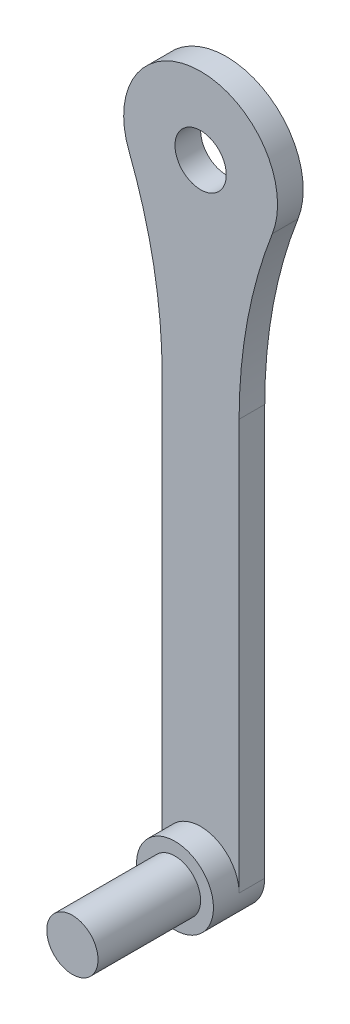
ISO-10303-21;
HEADER;
FILE_DESCRIPTION(('STEP AP214'),'2;1');
FILE_NAME('part.step','',(''),(''),'','','');
FILE_SCHEMA(('AUTOMOTIVE_DESIGN { 1 0 10303 214 1 1 1 1 }'));
ENDSEC;
DATA;
#1=APPLICATION_CONTEXT('core data for automotive mechanical design processes');
#2=APPLICATION_PROTOCOL_DEFINITION('international standard','automotive_design',2000,#1);
#3=PRODUCT_CONTEXT('',#1,'mechanical');
#4=PRODUCT('Part','Part','',(#3));
#5=PRODUCT_RELATED_PRODUCT_CATEGORY('part','',(#4));
#6=PRODUCT_DEFINITION_FORMATION('','',#4);
#7=PRODUCT_DEFINITION_CONTEXT('part definition',#1,'design');
#8=PRODUCT_DEFINITION('design','',#6,#7);
#9=PRODUCT_DEFINITION_SHAPE('','',#8);
#10=(LENGTH_UNIT() NAMED_UNIT(*) SI_UNIT(.MILLI.,.METRE.));
#11=(NAMED_UNIT(*) PLANE_ANGLE_UNIT() SI_UNIT($,.RADIAN.));
#12=(NAMED_UNIT(*) SI_UNIT($,.STERADIAN.) SOLID_ANGLE_UNIT());
#13=UNCERTAINTY_MEASURE_WITH_UNIT(LENGTH_MEASURE(1.E-05),#10,'distance_accuracy_value','');
#14=(GEOMETRIC_REPRESENTATION_CONTEXT(3) GLOBAL_UNCERTAINTY_ASSIGNED_CONTEXT((#13)) GLOBAL_UNIT_ASSIGNED_CONTEXT((#10,
#11,#12)) REPRESENTATION_CONTEXT('',''));
#15=CARTESIAN_POINT('',(0.,0.,0.));
#16=DIRECTION('',(0.,0.,1.));
#17=DIRECTION('',(1.,0.,0.));
#18=AXIS2_PLACEMENT_3D('',#15,#16,#17);
#19=CARTESIAN_POINT('',(9.29984388109428E-10,-120.,5.));
#20=DIRECTION('',(0.,0.,-1.));
#21=DIRECTION('',(-1.,0.,0.));
#22=AXIS2_PLACEMENT_3D('',#19,#20,#21);
#23=PLANE('',#22);
#24=CARTESIAN_POINT('',(0.,0.,5.));
#25=DIRECTION('',(0.,0.,-1.));
#26=DIRECTION('',(-1.,0.,0.));
#27=AXIS2_PLACEMENT_3D('',#24,#25,#26);
#28=CIRCLE('',#27,4.99999999999999);
#29=CARTESIAN_POINT('',(-4.99999999999999,0.,5.));
#30=VERTEX_POINT('',#29);
#31=EDGE_CURVE('E151',#30,#30,#28,.T.);
#32=ORIENTED_EDGE('',*,*,#31,.T.);
#33=EDGE_LOOP('',(#32));
#34=FACE_BOUND('',#33,.T.);
#35=CARTESIAN_POINT('',(0.,-120.,5.));
#36=DIRECTION('',(0.,0.,1.));
#37=DIRECTION('',(1.,0.,0.));
#38=AXIS2_PLACEMENT_3D('',#35,#36,#37);
#39=CIRCLE('',#38,7.50000000000001);
#40=CARTESIAN_POINT('',(7.50000000000001,-120.,5.));
#41=VERTEX_POINT('',#40);
#42=CARTESIAN_POINT('',(-7.49999999814002,-120.,5.));
#43=VERTEX_POINT('',#42);
#44=EDGE_CURVE('E93',#41,#43,#39,.T.);
#45=ORIENTED_EDGE('',*,*,#44,.F.);
#46=DIRECTION('',(0.,-1.,0.));
#47=VECTOR('',#46,1.);
#48=CARTESIAN_POINT('',(7.5,-12.9903810567666,5.));
#49=LINE('',#48,#47);
#50=CARTESIAN_POINT('',(7.49999999999999,-40.0000000019184,5.));
#51=VERTEX_POINT('',#50);
#52=EDGE_CURVE('E81',#51,#41,#49,.T.);
#53=ORIENTED_EDGE('',*,*,#52,.F.);
#54=CARTESIAN_POINT('',(102.916666667,-40.0000000019184,5.));
#55=DIRECTION('',(0.,0.,-1.));
#56=DIRECTION('',(-1.,0.,0.));
#57=AXIS2_PLACEMENT_3D('',#54,#55,#56);
#58=CIRCLE('',#57,95.416666667);
#59=CARTESIAN_POINT('',(13.9811320762784,-5.43396226393116,5.));
#60=VERTEX_POINT('',#59);
#61=EDGE_CURVE('E11',#51,#60,#58,.T.);
#62=ORIENTED_EDGE('',*,*,#61,.T.);
#63=CARTESIAN_POINT('',(9.29990893322463E-10,5.36929875560865E-10,5.));
#64=DIRECTION('',(0.,0.,-1.));
#65=DIRECTION('',(-1.,0.,0.));
#66=AXIS2_PLACEMENT_3D('',#63,#64,#65);
#67=CIRCLE('',#66,15.);
#68=CARTESIAN_POINT('',(-13.9811320744184,-5.43396226393116,5.));
#69=VERTEX_POINT('',#68);
#70=EDGE_CURVE('E90',#69,#60,#67,.T.);
#71=ORIENTED_EDGE('',*,*,#70,.F.);
#72=CARTESIAN_POINT('',(-102.91666666514,-40.0000000019184,5.));
#73=DIRECTION('',(0.,0.,-1.));
#74=DIRECTION('',(-1.,0.,0.));
#75=AXIS2_PLACEMENT_3D('',#72,#73,#74);
#76=CIRCLE('',#75,95.416666667);
#77=CARTESIAN_POINT('',(-7.49999999814002,-40.0000000019184,5.));
#78=VERTEX_POINT('',#77);
#79=EDGE_CURVE('E122',#69,#78,#76,.T.);
#80=ORIENTED_EDGE('',*,*,#79,.T.);
#81=DIRECTION('',(0.,1.,0.));
#82=VECTOR('',#81,1.);
#83=CARTESIAN_POINT('',(-7.49999999814002,-120.,5.));
#84=LINE('',#83,#82);
#85=EDGE_CURVE('E95',#43,#78,#84,.T.);
#86=ORIENTED_EDGE('',*,*,#85,.F.);
#87=EDGE_LOOP('',(#45,#53,#62,#71,#80,#86));
#88=FACE_BOUND('',#87,.T.);
#89=ADVANCED_FACE('F32',(#34,#88),#23,.F.);
#90=CARTESIAN_POINT('',(9.29984388109428E-10,-120.,5.));
#91=DIRECTION('',(0.,0.,-1.));
#92=DIRECTION('',(-1.,0.,0.));
#93=AXIS2_PLACEMENT_3D('',#90,#91,#92);
#94=CYLINDRICAL_SURFACE('',#93,7.49999999907);
#95=CARTESIAN_POINT('',(9.29984388109428E-10,-120.,0.));
#96=DIRECTION('',(0.,0.,-1.));
#97=DIRECTION('',(-1.,0.,0.));
#98=AXIS2_PLACEMENT_3D('',#95,#96,#97);
#99=CIRCLE('',#98,7.49999999907);
#100=CARTESIAN_POINT('',(7.49999999999998,-120.,0.));
#101=VERTEX_POINT('',#100);
#102=CARTESIAN_POINT('',(-7.49999999814002,-120.,0.));
#103=VERTEX_POINT('',#102);
#104=EDGE_CURVE('E104',#101,#103,#99,.T.);
#105=ORIENTED_EDGE('',*,*,#104,.F.);
#106=DIRECTION('',(0.,0.,-1.));
#107=VECTOR('',#106,1.);
#108=CARTESIAN_POINT('',(7.49999999999998,-120.,5.));
#109=LINE('',#108,#107);
#110=EDGE_CURVE('E85',#41,#101,#109,.T.);
#111=ORIENTED_EDGE('',*,*,#110,.F.);
#112=ORIENTED_EDGE('',*,*,#44,.T.);
#113=DIRECTION('',(0.,0.,-1.));
#114=VECTOR('',#113,1.);
#115=CARTESIAN_POINT('',(-7.49999999814002,-120.,5.));
#116=LINE('',#115,#114);
#117=EDGE_CURVE('E89',#43,#103,#116,.T.);
#118=ORIENTED_EDGE('',*,*,#117,.T.);
#119=EDGE_LOOP('',(#105,#111,#112,#118));
#120=FACE_BOUND('',#119,.T.);
#121=CARTESIAN_POINT('',(0.,-120.,10.));
#122=DIRECTION('',(0.,0.,1.));
#123=DIRECTION('',(1.,0.,0.));
#124=AXIS2_PLACEMENT_3D('',#121,#122,#123);
#125=CIRCLE('',#124,7.50000000000001);
#126=CARTESIAN_POINT('',(7.50000000000001,-120.,10.));
#127=VERTEX_POINT('',#126);
#128=EDGE_CURVE('E98',#127,#127,#125,.T.);
#129=ORIENTED_EDGE('',*,*,#128,.F.);
#130=EDGE_LOOP('',(#129));
#131=FACE_BOUND('',#130,.T.);
#132=ADVANCED_FACE('F101',(#120,#131),#94,.T.);
#133=CARTESIAN_POINT('',(7.5,-12.9903810567666,5.));
#134=DIRECTION('',(1.,0.,0.));
#135=DIRECTION('',(0.,1.,0.));
#136=AXIS2_PLACEMENT_3D('',#133,#134,#135);
#137=PLANE('',#136);
#138=DIRECTION('',(0.,-1.,0.));
#139=VECTOR('',#138,1.);
#140=CARTESIAN_POINT('',(7.5,-12.9903810567666,0.));
#141=LINE('',#140,#139);
#142=CARTESIAN_POINT('',(7.49999999999999,-40.0000000019184,0.));
#143=VERTEX_POINT('',#142);
#144=EDGE_CURVE('E112',#143,#101,#141,.T.);
#145=ORIENTED_EDGE('',*,*,#144,.F.);
#146=DIRECTION('',(0.,0.,1.));
#147=VECTOR('',#146,1.);
#148=CARTESIAN_POINT('',(7.49999999999999,-40.0000000019184,5.));
#149=LINE('',#148,#147);
#150=EDGE_CURVE('E47',#143,#51,#149,.T.);
#151=ORIENTED_EDGE('',*,*,#150,.T.);
#152=ORIENTED_EDGE('',*,*,#52,.T.);
#153=ORIENTED_EDGE('',*,*,#110,.T.);
#154=EDGE_LOOP('',(#145,#151,#152,#153));
#155=FACE_BOUND('',#154,.T.);
#156=ADVANCED_FACE('F83',(#155),#137,.T.);
#157=CARTESIAN_POINT('',(9.29990893322463E-10,5.36929875560865E-10,5.));
#158=DIRECTION('',(0.,0.,-1.));
#159=DIRECTION('',(-1.,0.,0.));
#160=AXIS2_PLACEMENT_3D('',#157,#158,#159);
#161=CYLINDRICAL_SURFACE('',#160,15.);
#162=CARTESIAN_POINT('',(9.29990893322463E-10,5.36929875560865E-10,0.));
#163=DIRECTION('',(0.,0.,-1.));
#164=DIRECTION('',(-1.,0.,0.));
#165=AXIS2_PLACEMENT_3D('',#162,#163,#164);
#166=CIRCLE('',#165,15.);
#167=CARTESIAN_POINT('',(-13.9811320744184,-5.43396226393116,0.));
#168=VERTEX_POINT('',#167);
#169=CARTESIAN_POINT('',(13.9811320762784,-5.43396226393116,0.));
#170=VERTEX_POINT('',#169);
#171=EDGE_CURVE('E137',#168,#170,#166,.T.);
#172=ORIENTED_EDGE('',*,*,#171,.F.);
#173=DIRECTION('',(0.,0.,-1.));
#174=VECTOR('',#173,1.);
#175=CARTESIAN_POINT('',(-13.9811320744184,-5.43396226393116,5.));
#176=LINE('',#175,#174);
#177=EDGE_CURVE('E117',#168,#69,#176,.F.);
#178=ORIENTED_EDGE('',*,*,#177,.T.);
#179=ORIENTED_EDGE('',*,*,#70,.T.);
#180=DIRECTION('',(0.,0.,-1.));
#181=VECTOR('',#180,1.);
#182=CARTESIAN_POINT('',(13.9811320762784,-5.43396226393116,5.));
#183=LINE('',#182,#181);
#184=EDGE_CURVE('E108',#60,#170,#183,.T.);
#185=ORIENTED_EDGE('',*,*,#184,.T.);
#186=EDGE_LOOP('',(#172,#178,#179,#185));
#187=FACE_BOUND('',#186,.T.);
#188=ADVANCED_FACE('F140',(#187),#161,.T.);
#189=CARTESIAN_POINT('',(-7.49999999814002,-120.,5.));
#190=DIRECTION('',(-1.,0.,0.));
#191=DIRECTION('',(0.,0.,1.));
#192=AXIS2_PLACEMENT_3D('',#189,#190,#191);
#193=PLANE('',#192);
#194=ORIENTED_EDGE('',*,*,#85,.T.);
#195=DIRECTION('',(0.,0.,1.));
#196=VECTOR('',#195,1.);
#197=CARTESIAN_POINT('',(-7.49999999814002,-40.0000000019184,0.));
#198=LINE('',#197,#196);
#199=CARTESIAN_POINT('',(-7.49999999814002,-40.0000000019184,0.));
#200=VERTEX_POINT('',#199);
#201=EDGE_CURVE('E105',#78,#200,#198,.F.);
#202=ORIENTED_EDGE('',*,*,#201,.T.);
#203=DIRECTION('',(0.,1.,0.));
#204=VECTOR('',#203,1.);
#205=CARTESIAN_POINT('',(-7.49999999814002,-120.,0.));
#206=LINE('',#205,#204);
#207=EDGE_CURVE('E138',#103,#200,#206,.T.);
#208=ORIENTED_EDGE('',*,*,#207,.F.);
#209=ORIENTED_EDGE('',*,*,#117,.F.);
#210=EDGE_LOOP('',(#194,#202,#208,#209));
#211=FACE_BOUND('',#210,.T.);
#212=ADVANCED_FACE('F130',(#211),#193,.T.);
#213=CARTESIAN_POINT('',(9.29984388109428E-10,-120.,0.));
#214=DIRECTION('',(0.,0.,-1.));
#215=DIRECTION('',(-1.,0.,0.));
#216=AXIS2_PLACEMENT_3D('',#213,#214,#215);
#217=PLANE('',#216);
#218=CARTESIAN_POINT('',(0.,0.,0.));
#219=DIRECTION('',(0.,0.,-1.));
#220=DIRECTION('',(-1.,0.,0.));
#221=AXIS2_PLACEMENT_3D('',#218,#219,#220);
#222=CIRCLE('',#221,4.99999999999999);
#223=CARTESIAN_POINT('',(-4.99999999999999,0.,0.));
#224=VERTEX_POINT('',#223);
#225=EDGE_CURVE('E156',#224,#224,#222,.T.);
#226=ORIENTED_EDGE('',*,*,#225,.F.);
#227=EDGE_LOOP('',(#226));
#228=FACE_BOUND('',#227,.T.);
#229=ORIENTED_EDGE('',*,*,#104,.T.);
#230=ORIENTED_EDGE('',*,*,#207,.T.);
#231=CARTESIAN_POINT('',(-102.91666666514,-40.0000000019184,0.));
#232=DIRECTION('',(0.,0.,-1.));
#233=DIRECTION('',(-1.,0.,0.));
#234=AXIS2_PLACEMENT_3D('',#231,#232,#233);
#235=CIRCLE('',#234,95.416666667);
#236=EDGE_CURVE('E120',#200,#168,#235,.F.);
#237=ORIENTED_EDGE('',*,*,#236,.T.);
#238=ORIENTED_EDGE('',*,*,#171,.T.);
#239=CARTESIAN_POINT('',(102.916666667,-40.0000000019184,0.));
#240=DIRECTION('',(0.,0.,-1.));
#241=DIRECTION('',(-1.,0.,0.));
#242=AXIS2_PLACEMENT_3D('',#239,#240,#241);
#243=CIRCLE('',#242,95.416666667);
#244=EDGE_CURVE('E40',#170,#143,#243,.F.);
#245=ORIENTED_EDGE('',*,*,#244,.T.);
#246=ORIENTED_EDGE('',*,*,#144,.T.);
#247=EDGE_LOOP('',(#229,#230,#237,#238,#245,#246));
#248=FACE_BOUND('',#247,.T.);
#249=ADVANCED_FACE('F136',(#228,#248),#217,.T.);
#250=CARTESIAN_POINT('',(0.,-120.,10.));
#251=DIRECTION('',(0.,0.,1.));
#252=DIRECTION('',(1.,0.,0.));
#253=AXIS2_PLACEMENT_3D('',#250,#251,#252);
#254=PLANE('',#253);
#255=CARTESIAN_POINT('',(0.,-120.,10.));
#256=DIRECTION('',(0.,0.,1.));
#257=DIRECTION('',(1.,0.,0.));
#258=AXIS2_PLACEMENT_3D('',#255,#256,#257);
#259=CIRCLE('',#258,5.);
#260=CARTESIAN_POINT('',(5.,-120.,10.));
#261=VERTEX_POINT('',#260);
#262=EDGE_CURVE('E148',#261,#261,#259,.T.);
#263=ORIENTED_EDGE('',*,*,#262,.F.);
#264=EDGE_LOOP('',(#263));
#265=FACE_BOUND('',#264,.T.);
#266=ORIENTED_EDGE('',*,*,#128,.T.);
#267=EDGE_LOOP('',(#266));
#268=FACE_BOUND('',#267,.T.);
#269=ADVANCED_FACE('F164',(#265,#268),#254,.T.);
#270=CARTESIAN_POINT('',(0.,-120.,30.));
#271=DIRECTION('',(0.,0.,-1.));
#272=DIRECTION('',(-1.,0.,0.));
#273=AXIS2_PLACEMENT_3D('',#270,#271,#272);
#274=CYLINDRICAL_SURFACE('',#273,5.);
#275=CARTESIAN_POINT('',(0.,-120.,30.));
#276=DIRECTION('',(0.,0.,1.));
#277=DIRECTION('',(1.,0.,0.));
#278=AXIS2_PLACEMENT_3D('',#275,#276,#277);
#279=CIRCLE('',#278,5.);
#280=CARTESIAN_POINT('',(5.,-120.,30.));
#281=VERTEX_POINT('',#280);
#282=EDGE_CURVE('E99',#281,#281,#279,.T.);
#283=ORIENTED_EDGE('',*,*,#282,.F.);
#284=EDGE_LOOP('',(#283));
#285=FACE_BOUND('',#284,.T.);
#286=ORIENTED_EDGE('',*,*,#262,.T.);
#287=EDGE_LOOP('',(#286));
#288=FACE_BOUND('',#287,.T.);
#289=ADVANCED_FACE('F170',(#285,#288),#274,.T.);
#290=CARTESIAN_POINT('',(0.,-120.,30.));
#291=DIRECTION('',(0.,0.,1.));
#292=DIRECTION('',(1.,0.,0.));
#293=AXIS2_PLACEMENT_3D('',#290,#291,#292);
#294=PLANE('',#293);
#295=ORIENTED_EDGE('',*,*,#282,.T.);
#296=EDGE_LOOP('',(#295));
#297=FACE_BOUND('',#296,.T.);
#298=ADVANCED_FACE('F185',(#297),#294,.T.);
#299=CARTESIAN_POINT('',(0.,0.,0.));
#300=DIRECTION('',(0.,0.,-1.));
#301=DIRECTION('',(-1.,0.,0.));
#302=AXIS2_PLACEMENT_3D('',#299,#300,#301);
#303=CYLINDRICAL_SURFACE('',#302,4.99999999999999);
#304=ORIENTED_EDGE('',*,*,#225,.T.);
#305=EDGE_LOOP('',(#304));
#306=FACE_BOUND('',#305,.T.);
#307=ORIENTED_EDGE('',*,*,#31,.F.);
#308=EDGE_LOOP('',(#307));
#309=FACE_BOUND('',#308,.T.);
#310=ADVANCED_FACE('F160',(#306,#309),#303,.F.);
#311=CARTESIAN_POINT('',(-102.91666666514,-40.0000000019184,5.));
#312=DIRECTION('',(0.,0.,-1.));
#313=DIRECTION('',(-1.,0.,0.));
#314=AXIS2_PLACEMENT_3D('',#311,#312,#313);
#315=CYLINDRICAL_SURFACE('',#314,95.416666667);
#316=ORIENTED_EDGE('',*,*,#79,.F.);
#317=ORIENTED_EDGE('',*,*,#177,.F.);
#318=ORIENTED_EDGE('',*,*,#236,.F.);
#319=ORIENTED_EDGE('',*,*,#201,.F.);
#320=EDGE_LOOP('',(#316,#317,#318,#319));
#321=FACE_BOUND('',#320,.T.);
#322=ADVANCED_FACE('F134',(#321),#315,.F.);
#323=CARTESIAN_POINT('',(102.916666667,-40.0000000019184,5.));
#324=DIRECTION('',(0.,0.,-1.));
#325=DIRECTION('',(-1.,0.,0.));
#326=AXIS2_PLACEMENT_3D('',#323,#324,#325);
#327=CYLINDRICAL_SURFACE('',#326,95.416666667);
#328=ORIENTED_EDGE('',*,*,#61,.F.);
#329=ORIENTED_EDGE('',*,*,#150,.F.);
#330=ORIENTED_EDGE('',*,*,#244,.F.);
#331=ORIENTED_EDGE('',*,*,#184,.F.);
#332=EDGE_LOOP('',(#328,#329,#330,#331));
#333=FACE_BOUND('',#332,.T.);
#334=ADVANCED_FACE('F34',(#333),#327,.F.);
#335=CLOSED_SHELL('',(#89,#132,#156,#188,#212,#249,#269,#289,#298,#310,#322,#334));
#336=MANIFOLD_SOLID_BREP('B2',#335);
#337=ADVANCED_BREP_SHAPE_REPRESENTATION('',(#18,#336),#14);
#338=SHAPE_DEFINITION_REPRESENTATION(#9,#337);
ENDSEC;
END-ISO-10303-21;
